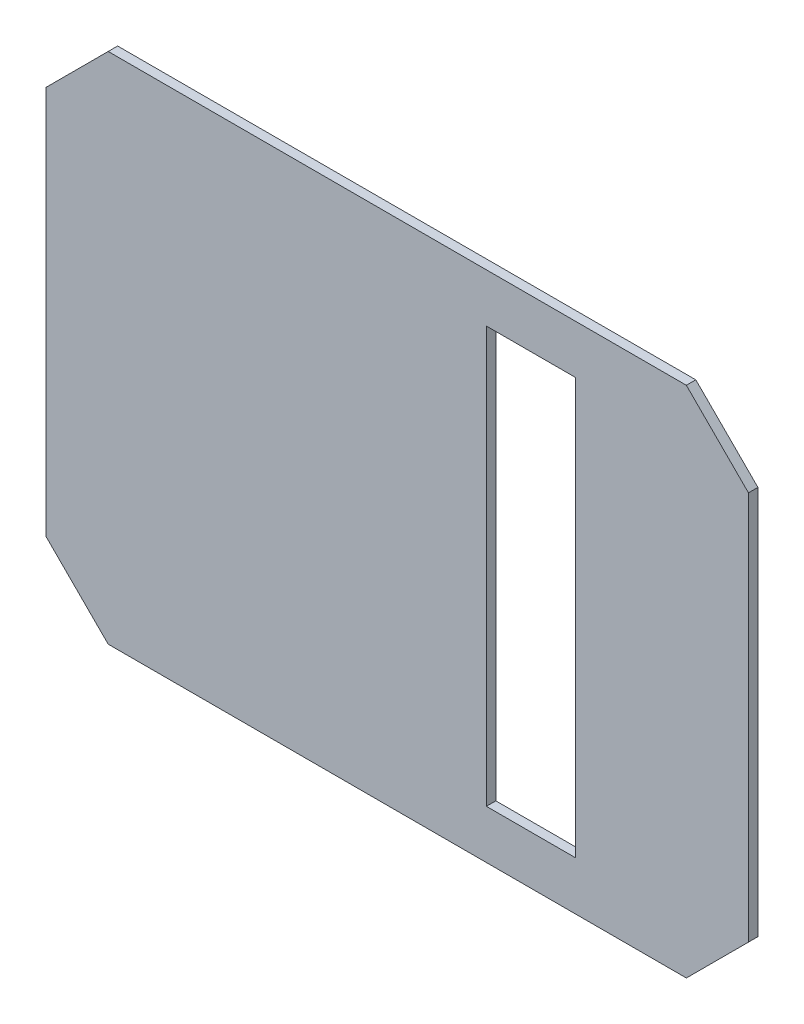
ISO-10303-21;
HEADER;
FILE_DESCRIPTION(('STEP AP214'),'2;1');
FILE_NAME('part.step','',(''),(''),'','','');
FILE_SCHEMA(('AUTOMOTIVE_DESIGN { 1 0 10303 214 1 1 1 1 }'));
ENDSEC;
DATA;
#1=APPLICATION_CONTEXT('core data for automotive mechanical design processes');
#2=APPLICATION_PROTOCOL_DEFINITION('international standard','automotive_design',2000,#1);
#3=PRODUCT_CONTEXT('',#1,'mechanical');
#4=PRODUCT('Part','Part','',(#3));
#5=PRODUCT_RELATED_PRODUCT_CATEGORY('part','',(#4));
#6=PRODUCT_DEFINITION_FORMATION('','',#4);
#7=PRODUCT_DEFINITION_CONTEXT('part definition',#1,'design');
#8=PRODUCT_DEFINITION('design','',#6,#7);
#9=PRODUCT_DEFINITION_SHAPE('','',#8);
#10=(LENGTH_UNIT() NAMED_UNIT(*) SI_UNIT(.MILLI.,.METRE.));
#11=(NAMED_UNIT(*) PLANE_ANGLE_UNIT() SI_UNIT($,.RADIAN.));
#12=(NAMED_UNIT(*) SI_UNIT($,.STERADIAN.) SOLID_ANGLE_UNIT());
#13=UNCERTAINTY_MEASURE_WITH_UNIT(LENGTH_MEASURE(1.E-05),#10,'distance_accuracy_value','');
#14=(GEOMETRIC_REPRESENTATION_CONTEXT(3) GLOBAL_UNCERTAINTY_ASSIGNED_CONTEXT((#13)) GLOBAL_UNIT_ASSIGNED_CONTEXT((#10,
#11,#12)) REPRESENTATION_CONTEXT('',''));
#15=CARTESIAN_POINT('',(0.,0.,0.));
#16=DIRECTION('',(0.,0.,1.));
#17=DIRECTION('',(1.,0.,0.));
#18=AXIS2_PLACEMENT_3D('',#15,#16,#17);
#19=CARTESIAN_POINT('',(117.95,-65.342135623731,3.175));
#20=DIRECTION('',(-0.707106781186548,0.707106781186548,0.));
#21=DIRECTION('',(-0.707106781186548,-0.707106781186548,0.));
#22=AXIS2_PLACEMENT_3D('',#19,#20,#21);
#23=PLANE('',#22);
#24=DIRECTION('',(0.707106781186547,0.707106781186547,0.));
#25=VECTOR('',#24,1.);
#26=CARTESIAN_POINT('',(117.95,-65.342135623731,0.));
#27=LINE('',#26,#25);
#28=CARTESIAN_POINT('',(97.092135623731,-86.2,0.));
#29=VERTEX_POINT('',#28);
#30=CARTESIAN_POINT('',(117.95,-65.342135623731,0.));
#31=VERTEX_POINT('',#30);
#32=EDGE_CURVE('E154',#29,#31,#27,.T.);
#33=ORIENTED_EDGE('',*,*,#32,.T.);
#34=DIRECTION('',(0.,0.,-1.));
#35=VECTOR('',#34,1.);
#36=CARTESIAN_POINT('',(117.95,-65.342135623731,3.175));
#37=LINE('',#36,#35);
#38=CARTESIAN_POINT('',(117.95,-65.342135623731,3.175));
#39=VERTEX_POINT('',#38);
#40=EDGE_CURVE('E11',#39,#31,#37,.T.);
#41=ORIENTED_EDGE('',*,*,#40,.F.);
#42=DIRECTION('',(0.707106781186547,0.707106781186547,0.));
#43=VECTOR('',#42,1.);
#44=CARTESIAN_POINT('',(117.95,-65.342135623731,3.175));
#45=LINE('',#44,#43);
#46=CARTESIAN_POINT('',(97.092135623731,-86.2,3.175));
#47=VERTEX_POINT('',#46);
#48=EDGE_CURVE('E158',#47,#39,#45,.T.);
#49=ORIENTED_EDGE('',*,*,#48,.F.);
#50=DIRECTION('',(0.,0.,-1.));
#51=VECTOR('',#50,1.);
#52=CARTESIAN_POINT('',(97.092135623731,-86.2,3.175));
#53=LINE('',#52,#51);
#54=EDGE_CURVE('E176',#47,#29,#53,.T.);
#55=ORIENTED_EDGE('',*,*,#54,.T.);
#56=EDGE_LOOP('',(#33,#41,#49,#55));
#57=FACE_BOUND('',#56,.T.);
#58=ADVANCED_FACE('F33',(#57),#23,.F.);
#59=CARTESIAN_POINT('',(117.95,65.3421356237309,3.175));
#60=DIRECTION('',(-1.,0.,0.));
#61=DIRECTION('',(0.,-1.,0.));
#62=AXIS2_PLACEMENT_3D('',#59,#60,#61);
#63=PLANE('',#62);
#64=DIRECTION('',(0.,1.,0.));
#65=VECTOR('',#64,1.);
#66=CARTESIAN_POINT('',(117.95,65.3421356237309,0.));
#67=LINE('',#66,#65);
#68=CARTESIAN_POINT('',(117.95,65.3421356237309,0.));
#69=VERTEX_POINT('',#68);
#70=EDGE_CURVE('E179',#31,#69,#67,.T.);
#71=ORIENTED_EDGE('',*,*,#70,.T.);
#72=DIRECTION('',(0.,0.,-1.));
#73=VECTOR('',#72,1.);
#74=CARTESIAN_POINT('',(117.95,65.3421356237309,3.175));
#75=LINE('',#74,#73);
#76=CARTESIAN_POINT('',(117.95,65.3421356237309,3.175));
#77=VERTEX_POINT('',#76);
#78=EDGE_CURVE('E40',#77,#69,#75,.T.);
#79=ORIENTED_EDGE('',*,*,#78,.F.);
#80=DIRECTION('',(0.,1.,0.));
#81=VECTOR('',#80,1.);
#82=CARTESIAN_POINT('',(117.95,65.3421356237309,3.175));
#83=LINE('',#82,#81);
#84=EDGE_CURVE('E161',#39,#77,#83,.T.);
#85=ORIENTED_EDGE('',*,*,#84,.F.);
#86=ORIENTED_EDGE('',*,*,#40,.T.);
#87=EDGE_LOOP('',(#71,#79,#85,#86));
#88=FACE_BOUND('',#87,.T.);
#89=ADVANCED_FACE('F234',(#88),#63,.F.);
#90=CARTESIAN_POINT('',(117.95,65.3421356237309,3.175));
#91=DIRECTION('',(-0.707106781186551,-0.707106781186544,0.));
#92=DIRECTION('',(0.707106781186544,-0.707106781186551,0.));
#93=AXIS2_PLACEMENT_3D('',#90,#91,#92);
#94=PLANE('',#93);
#95=DIRECTION('',(-0.707106781186544,0.707106781186551,0.));
#96=VECTOR('',#95,1.);
#97=CARTESIAN_POINT('',(117.95,65.3421356237309,0.));
#98=LINE('',#97,#96);
#99=CARTESIAN_POINT('',(97.092135623731,86.2,0.));
#100=VERTEX_POINT('',#99);
#101=EDGE_CURVE('E181',#69,#100,#98,.T.);
#102=ORIENTED_EDGE('',*,*,#101,.T.);
#103=DIRECTION('',(0.,0.,-1.));
#104=VECTOR('',#103,1.);
#105=CARTESIAN_POINT('',(97.092135623731,86.2,3.175));
#106=LINE('',#105,#104);
#107=CARTESIAN_POINT('',(97.092135623731,86.2,3.175));
#108=VERTEX_POINT('',#107);
#109=EDGE_CURVE('E206',#108,#100,#106,.T.);
#110=ORIENTED_EDGE('',*,*,#109,.F.);
#111=DIRECTION('',(-0.707106781186544,0.707106781186551,0.));
#112=VECTOR('',#111,1.);
#113=CARTESIAN_POINT('',(117.95,65.3421356237309,3.175));
#114=LINE('',#113,#112);
#115=EDGE_CURVE('E164',#77,#108,#114,.T.);
#116=ORIENTED_EDGE('',*,*,#115,.F.);
#117=ORIENTED_EDGE('',*,*,#78,.T.);
#118=EDGE_LOOP('',(#102,#110,#116,#117));
#119=FACE_BOUND('',#118,.T.);
#120=ADVANCED_FACE('F213',(#119),#94,.F.);
#121=CARTESIAN_POINT('',(97.092135623731,86.2,3.175));
#122=DIRECTION('',(0.,-1.,0.));
#123=DIRECTION('',(0.,0.,-1.));
#124=AXIS2_PLACEMENT_3D('',#121,#122,#123);
#125=PLANE('',#124);
#126=DIRECTION('',(-1.,0.,0.));
#127=VECTOR('',#126,1.);
#128=CARTESIAN_POINT('',(97.092135623731,86.2,0.));
#129=LINE('',#128,#127);
#130=CARTESIAN_POINT('',(-97.092135623731,86.2,0.));
#131=VERTEX_POINT('',#130);
#132=EDGE_CURVE('E183',#100,#131,#129,.T.);
#133=ORIENTED_EDGE('',*,*,#132,.T.);
#134=DIRECTION('',(0.,0.,-1.));
#135=VECTOR('',#134,1.);
#136=CARTESIAN_POINT('',(-97.092135623731,86.2,3.175));
#137=LINE('',#136,#135);
#138=CARTESIAN_POINT('',(-97.092135623731,86.2,3.175));
#139=VERTEX_POINT('',#138);
#140=EDGE_CURVE('E203',#139,#131,#137,.T.);
#141=ORIENTED_EDGE('',*,*,#140,.F.);
#142=DIRECTION('',(-1.,0.,0.));
#143=VECTOR('',#142,1.);
#144=CARTESIAN_POINT('',(97.092135623731,86.2,3.175));
#145=LINE('',#144,#143);
#146=EDGE_CURVE('E166',#108,#139,#145,.T.);
#147=ORIENTED_EDGE('',*,*,#146,.F.);
#148=ORIENTED_EDGE('',*,*,#109,.T.);
#149=EDGE_LOOP('',(#133,#141,#147,#148));
#150=FACE_BOUND('',#149,.T.);
#151=ADVANCED_FACE('F222',(#150),#125,.F.);
#152=CARTESIAN_POINT('',(-97.092135623731,86.2,3.175));
#153=DIRECTION('',(0.707106781186547,-0.707106781186548,0.));
#154=DIRECTION('',(0.707106781186548,0.707106781186547,0.));
#155=AXIS2_PLACEMENT_3D('',#152,#153,#154);
#156=PLANE('',#155);
#157=DIRECTION('',(-0.707106781186548,-0.707106781186547,0.));
#158=VECTOR('',#157,1.);
#159=CARTESIAN_POINT('',(-97.092135623731,86.2,0.));
#160=LINE('',#159,#158);
#161=CARTESIAN_POINT('',(-117.95,65.342135623731,0.));
#162=VERTEX_POINT('',#161);
#163=EDGE_CURVE('E185',#131,#162,#160,.T.);
#164=ORIENTED_EDGE('',*,*,#163,.T.);
#165=DIRECTION('',(0.,0.,-1.));
#166=VECTOR('',#165,1.);
#167=CARTESIAN_POINT('',(-117.95,65.342135623731,3.175));
#168=LINE('',#167,#166);
#169=CARTESIAN_POINT('',(-117.95,65.342135623731,3.175));
#170=VERTEX_POINT('',#169);
#171=EDGE_CURVE('E200',#170,#162,#168,.T.);
#172=ORIENTED_EDGE('',*,*,#171,.F.);
#173=DIRECTION('',(-0.707106781186548,-0.707106781186547,0.));
#174=VECTOR('',#173,1.);
#175=CARTESIAN_POINT('',(-97.092135623731,86.2,3.175));
#176=LINE('',#175,#174);
#177=EDGE_CURVE('E168',#139,#170,#176,.T.);
#178=ORIENTED_EDGE('',*,*,#177,.F.);
#179=ORIENTED_EDGE('',*,*,#140,.T.);
#180=EDGE_LOOP('',(#164,#172,#178,#179));
#181=FACE_BOUND('',#180,.T.);
#182=ADVANCED_FACE('F226',(#181),#156,.F.);
#183=CARTESIAN_POINT('',(-117.95,65.342135623731,3.175));
#184=DIRECTION('',(1.,0.,0.));
#185=DIRECTION('',(0.,0.,-1.));
#186=AXIS2_PLACEMENT_3D('',#183,#184,#185);
#187=PLANE('',#186);
#188=DIRECTION('',(0.,-1.,0.));
#189=VECTOR('',#188,1.);
#190=CARTESIAN_POINT('',(-117.95,65.342135623731,0.));
#191=LINE('',#190,#189);
#192=CARTESIAN_POINT('',(-117.95,-65.342135623731,0.));
#193=VERTEX_POINT('',#192);
#194=EDGE_CURVE('E187',#162,#193,#191,.T.);
#195=ORIENTED_EDGE('',*,*,#194,.T.);
#196=DIRECTION('',(0.,0.,-1.));
#197=VECTOR('',#196,1.);
#198=CARTESIAN_POINT('',(-117.95,-65.342135623731,3.175));
#199=LINE('',#198,#197);
#200=CARTESIAN_POINT('',(-117.95,-65.342135623731,3.175));
#201=VERTEX_POINT('',#200);
#202=EDGE_CURVE('E197',#201,#193,#199,.T.);
#203=ORIENTED_EDGE('',*,*,#202,.F.);
#204=DIRECTION('',(0.,-1.,0.));
#205=VECTOR('',#204,1.);
#206=CARTESIAN_POINT('',(-117.95,65.342135623731,3.175));
#207=LINE('',#206,#205);
#208=EDGE_CURVE('E170',#170,#201,#207,.T.);
#209=ORIENTED_EDGE('',*,*,#208,.F.);
#210=ORIENTED_EDGE('',*,*,#171,.T.);
#211=EDGE_LOOP('',(#195,#203,#209,#210));
#212=FACE_BOUND('',#211,.T.);
#213=ADVANCED_FACE('F247',(#212),#187,.F.);
#214=CARTESIAN_POINT('',(-97.092135623731,-86.2,3.175));
#215=DIRECTION('',(0.707106781186548,0.707106781186547,0.));
#216=DIRECTION('',(-0.707106781186547,0.707106781186548,0.));
#217=AXIS2_PLACEMENT_3D('',#214,#215,#216);
#218=PLANE('',#217);
#219=DIRECTION('',(0.707106781186547,-0.707106781186548,0.));
#220=VECTOR('',#219,1.);
#221=CARTESIAN_POINT('',(-97.092135623731,-86.2,0.));
#222=LINE('',#221,#220);
#223=CARTESIAN_POINT('',(-97.092135623731,-86.2,0.));
#224=VERTEX_POINT('',#223);
#225=EDGE_CURVE('E189',#193,#224,#222,.T.);
#226=ORIENTED_EDGE('',*,*,#225,.T.);
#227=DIRECTION('',(0.,0.,-1.));
#228=VECTOR('',#227,1.);
#229=CARTESIAN_POINT('',(-97.092135623731,-86.2,3.175));
#230=LINE('',#229,#228);
#231=CARTESIAN_POINT('',(-97.092135623731,-86.2,3.175));
#232=VERTEX_POINT('',#231);
#233=EDGE_CURVE('E194',#232,#224,#230,.T.);
#234=ORIENTED_EDGE('',*,*,#233,.F.);
#235=DIRECTION('',(0.707106781186547,-0.707106781186548,0.));
#236=VECTOR('',#235,1.);
#237=CARTESIAN_POINT('',(-97.092135623731,-86.2,3.175));
#238=LINE('',#237,#236);
#239=EDGE_CURVE('E172',#201,#232,#238,.T.);
#240=ORIENTED_EDGE('',*,*,#239,.F.);
#241=ORIENTED_EDGE('',*,*,#202,.T.);
#242=EDGE_LOOP('',(#226,#234,#240,#241));
#243=FACE_BOUND('',#242,.T.);
#244=ADVANCED_FACE('F245',(#243),#218,.F.);
#245=CARTESIAN_POINT('',(97.092135623731,-86.2,3.175));
#246=DIRECTION('',(0.,1.,0.));
#247=DIRECTION('',(0.,0.,1.));
#248=AXIS2_PLACEMENT_3D('',#245,#246,#247);
#249=PLANE('',#248);
#250=DIRECTION('',(1.,0.,0.));
#251=VECTOR('',#250,1.);
#252=CARTESIAN_POINT('',(97.092135623731,-86.2,0.));
#253=LINE('',#252,#251);
#254=EDGE_CURVE('E162',#224,#29,#253,.T.);
#255=ORIENTED_EDGE('',*,*,#254,.T.);
#256=ORIENTED_EDGE('',*,*,#54,.F.);
#257=DIRECTION('',(1.,0.,0.));
#258=VECTOR('',#257,1.);
#259=CARTESIAN_POINT('',(97.092135623731,-86.2,3.175));
#260=LINE('',#259,#258);
#261=EDGE_CURVE('E174',#232,#47,#260,.T.);
#262=ORIENTED_EDGE('',*,*,#261,.F.);
#263=ORIENTED_EDGE('',*,*,#233,.T.);
#264=EDGE_LOOP('',(#255,#256,#262,#263));
#265=FACE_BOUND('',#264,.T.);
#266=ADVANCED_FACE('F240',(#265),#249,.F.);
#267=CARTESIAN_POINT('',(0.,0.,3.175));
#268=DIRECTION('',(0.,0.,-1.));
#269=DIRECTION('',(-1.,0.,0.));
#270=AXIS2_PLACEMENT_3D('',#267,#268,#269);
#271=PLANE('',#270);
#272=DIRECTION('',(1.,0.,0.));
#273=VECTOR('',#272,1.);
#274=CARTESIAN_POINT('',(59.925,-69.8499999999999,3.175));
#275=LINE('',#274,#273);
#276=CARTESIAN_POINT('',(29.925,-69.8499999999999,3.175));
#277=VERTEX_POINT('',#276);
#278=CARTESIAN_POINT('',(59.925,-69.8499999999999,3.175));
#279=VERTEX_POINT('',#278);
#280=EDGE_CURVE('E148',#277,#279,#275,.T.);
#281=ORIENTED_EDGE('',*,*,#280,.F.);
#282=DIRECTION('',(0.,-1.,0.));
#283=VECTOR('',#282,1.);
#284=CARTESIAN_POINT('',(29.925,69.8499999999999,3.175));
#285=LINE('',#284,#283);
#286=CARTESIAN_POINT('',(29.925,69.8499999999999,3.175));
#287=VERTEX_POINT('',#286);
#288=EDGE_CURVE('E47',#287,#277,#285,.T.);
#289=ORIENTED_EDGE('',*,*,#288,.F.);
#290=DIRECTION('',(-1.,0.,0.));
#291=VECTOR('',#290,1.);
#292=CARTESIAN_POINT('',(59.925,69.8499999999999,3.175));
#293=LINE('',#292,#291);
#294=CARTESIAN_POINT('',(59.925,69.8499999999999,3.175));
#295=VERTEX_POINT('',#294);
#296=EDGE_CURVE('E139',#295,#287,#293,.T.);
#297=ORIENTED_EDGE('',*,*,#296,.F.);
#298=DIRECTION('',(0.,1.,0.));
#299=VECTOR('',#298,1.);
#300=CARTESIAN_POINT('',(59.925,69.8499999999999,3.175));
#301=LINE('',#300,#299);
#302=EDGE_CURVE('E142',#279,#295,#301,.T.);
#303=ORIENTED_EDGE('',*,*,#302,.F.);
#304=EDGE_LOOP('',(#281,#289,#297,#303));
#305=FACE_BOUND('',#304,.T.);
#306=ORIENTED_EDGE('',*,*,#48,.T.);
#307=ORIENTED_EDGE('',*,*,#84,.T.);
#308=ORIENTED_EDGE('',*,*,#115,.T.);
#309=ORIENTED_EDGE('',*,*,#146,.T.);
#310=ORIENTED_EDGE('',*,*,#177,.T.);
#311=ORIENTED_EDGE('',*,*,#208,.T.);
#312=ORIENTED_EDGE('',*,*,#239,.T.);
#313=ORIENTED_EDGE('',*,*,#261,.T.);
#314=EDGE_LOOP('',(#306,#307,#308,#309,#310,#311,#312,#313));
#315=FACE_BOUND('',#314,.T.);
#316=ADVANCED_FACE('F230',(#305,#315),#271,.F.);
#317=CARTESIAN_POINT('',(0.,0.,0.));
#318=DIRECTION('',(0.,0.,-1.));
#319=DIRECTION('',(-1.,0.,0.));
#320=AXIS2_PLACEMENT_3D('',#317,#318,#319);
#321=PLANE('',#320);
#322=DIRECTION('',(0.,-1.,0.));
#323=VECTOR('',#322,1.);
#324=CARTESIAN_POINT('',(29.925,69.8499999999999,0.));
#325=LINE('',#324,#323);
#326=CARTESIAN_POINT('',(29.925,69.8499999999999,0.));
#327=VERTEX_POINT('',#326);
#328=CARTESIAN_POINT('',(29.925,-69.8499999999999,0.));
#329=VERTEX_POINT('',#328);
#330=EDGE_CURVE('E123',#327,#329,#325,.T.);
#331=ORIENTED_EDGE('',*,*,#330,.T.);
#332=DIRECTION('',(1.,0.,0.));
#333=VECTOR('',#332,1.);
#334=CARTESIAN_POINT('',(59.925,-69.8499999999999,0.));
#335=LINE('',#334,#333);
#336=CARTESIAN_POINT('',(59.925,-69.8499999999999,0.));
#337=VERTEX_POINT('',#336);
#338=EDGE_CURVE('E132',#329,#337,#335,.T.);
#339=ORIENTED_EDGE('',*,*,#338,.T.);
#340=DIRECTION('',(0.,1.,0.));
#341=VECTOR('',#340,1.);
#342=CARTESIAN_POINT('',(59.925,69.8499999999999,0.));
#343=LINE('',#342,#341);
#344=CARTESIAN_POINT('',(59.925,69.8499999999999,0.));
#345=VERTEX_POINT('',#344);
#346=EDGE_CURVE('E55',#337,#345,#343,.T.);
#347=ORIENTED_EDGE('',*,*,#346,.T.);
#348=DIRECTION('',(-1.,0.,0.));
#349=VECTOR('',#348,1.);
#350=CARTESIAN_POINT('',(59.925,69.8499999999999,0.));
#351=LINE('',#350,#349);
#352=EDGE_CURVE('E129',#345,#327,#351,.T.);
#353=ORIENTED_EDGE('',*,*,#352,.T.);
#354=EDGE_LOOP('',(#331,#339,#347,#353));
#355=FACE_BOUND('',#354,.T.);
#356=ORIENTED_EDGE('',*,*,#32,.F.);
#357=ORIENTED_EDGE('',*,*,#254,.F.);
#358=ORIENTED_EDGE('',*,*,#225,.F.);
#359=ORIENTED_EDGE('',*,*,#194,.F.);
#360=ORIENTED_EDGE('',*,*,#163,.F.);
#361=ORIENTED_EDGE('',*,*,#132,.F.);
#362=ORIENTED_EDGE('',*,*,#101,.F.);
#363=ORIENTED_EDGE('',*,*,#70,.F.);
#364=EDGE_LOOP('',(#356,#357,#358,#359,#360,#361,#362,#363));
#365=FACE_BOUND('',#364,.T.);
#366=ADVANCED_FACE('F136',(#355,#365),#321,.T.);
#367=CARTESIAN_POINT('',(29.925,69.8499999999999,0.));
#368=DIRECTION('',(-1.,0.,0.));
#369=DIRECTION('',(0.,-1.,0.));
#370=AXIS2_PLACEMENT_3D('',#367,#368,#369);
#371=PLANE('',#370);
#372=ORIENTED_EDGE('',*,*,#288,.T.);
#373=DIRECTION('',(0.,0.,1.));
#374=VECTOR('',#373,1.);
#375=CARTESIAN_POINT('',(29.925,-69.8499999999999,0.));
#376=LINE('',#375,#374);
#377=EDGE_CURVE('E119',#329,#277,#376,.T.);
#378=ORIENTED_EDGE('',*,*,#377,.F.);
#379=ORIENTED_EDGE('',*,*,#330,.F.);
#380=DIRECTION('',(0.,0.,1.));
#381=VECTOR('',#380,1.);
#382=CARTESIAN_POINT('',(29.925,69.8499999999999,0.));
#383=LINE('',#382,#381);
#384=EDGE_CURVE('E152',#327,#287,#383,.T.);
#385=ORIENTED_EDGE('',*,*,#384,.T.);
#386=EDGE_LOOP('',(#372,#378,#379,#385));
#387=FACE_BOUND('',#386,.T.);
#388=ADVANCED_FACE('F121',(#387),#371,.F.);
#389=CARTESIAN_POINT('',(59.925,69.8499999999999,0.));
#390=DIRECTION('',(0.,1.,0.));
#391=DIRECTION('',(0.,0.,1.));
#392=AXIS2_PLACEMENT_3D('',#389,#390,#391);
#393=PLANE('',#392);
#394=ORIENTED_EDGE('',*,*,#296,.T.);
#395=ORIENTED_EDGE('',*,*,#384,.F.);
#396=ORIENTED_EDGE('',*,*,#352,.F.);
#397=DIRECTION('',(0.,0.,1.));
#398=VECTOR('',#397,1.);
#399=CARTESIAN_POINT('',(59.925,69.8499999999999,0.));
#400=LINE('',#399,#398);
#401=EDGE_CURVE('E155',#345,#295,#400,.T.);
#402=ORIENTED_EDGE('',*,*,#401,.T.);
#403=EDGE_LOOP('',(#394,#395,#396,#402));
#404=FACE_BOUND('',#403,.T.);
#405=ADVANCED_FACE('F318',(#404),#393,.F.);
#406=CARTESIAN_POINT('',(59.925,69.8499999999999,0.));
#407=DIRECTION('',(1.,0.,0.));
#408=DIRECTION('',(0.,0.,-1.));
#409=AXIS2_PLACEMENT_3D('',#406,#407,#408);
#410=PLANE('',#409);
#411=ORIENTED_EDGE('',*,*,#302,.T.);
#412=ORIENTED_EDGE('',*,*,#401,.F.);
#413=ORIENTED_EDGE('',*,*,#346,.F.);
#414=DIRECTION('',(0.,0.,1.));
#415=VECTOR('',#414,1.);
#416=CARTESIAN_POINT('',(59.925,-69.8499999999999,0.));
#417=LINE('',#416,#415);
#418=EDGE_CURVE('E128',#337,#279,#417,.T.);
#419=ORIENTED_EDGE('',*,*,#418,.T.);
#420=EDGE_LOOP('',(#411,#412,#413,#419));
#421=FACE_BOUND('',#420,.T.);
#422=ADVANCED_FACE('F327',(#421),#410,.F.);
#423=CARTESIAN_POINT('',(59.925,-69.8499999999999,0.));
#424=DIRECTION('',(0.,-1.,0.));
#425=DIRECTION('',(0.,0.,-1.));
#426=AXIS2_PLACEMENT_3D('',#423,#424,#425);
#427=PLANE('',#426);
#428=ORIENTED_EDGE('',*,*,#280,.T.);
#429=ORIENTED_EDGE('',*,*,#418,.F.);
#430=ORIENTED_EDGE('',*,*,#338,.F.);
#431=ORIENTED_EDGE('',*,*,#377,.T.);
#432=EDGE_LOOP('',(#428,#429,#430,#431));
#433=FACE_BOUND('',#432,.T.);
#434=ADVANCED_FACE('F133',(#433),#427,.F.);
#435=CLOSED_SHELL('',(#58,#89,#120,#151,#182,#213,#244,#266,#316,#366,#388,#405,#422,#434));
#436=MANIFOLD_SOLID_BREP('B2',#435);
#437=ADVANCED_BREP_SHAPE_REPRESENTATION('',(#18,#436),#14);
#438=SHAPE_DEFINITION_REPRESENTATION(#9,#437);
ENDSEC;
END-ISO-10303-21;
